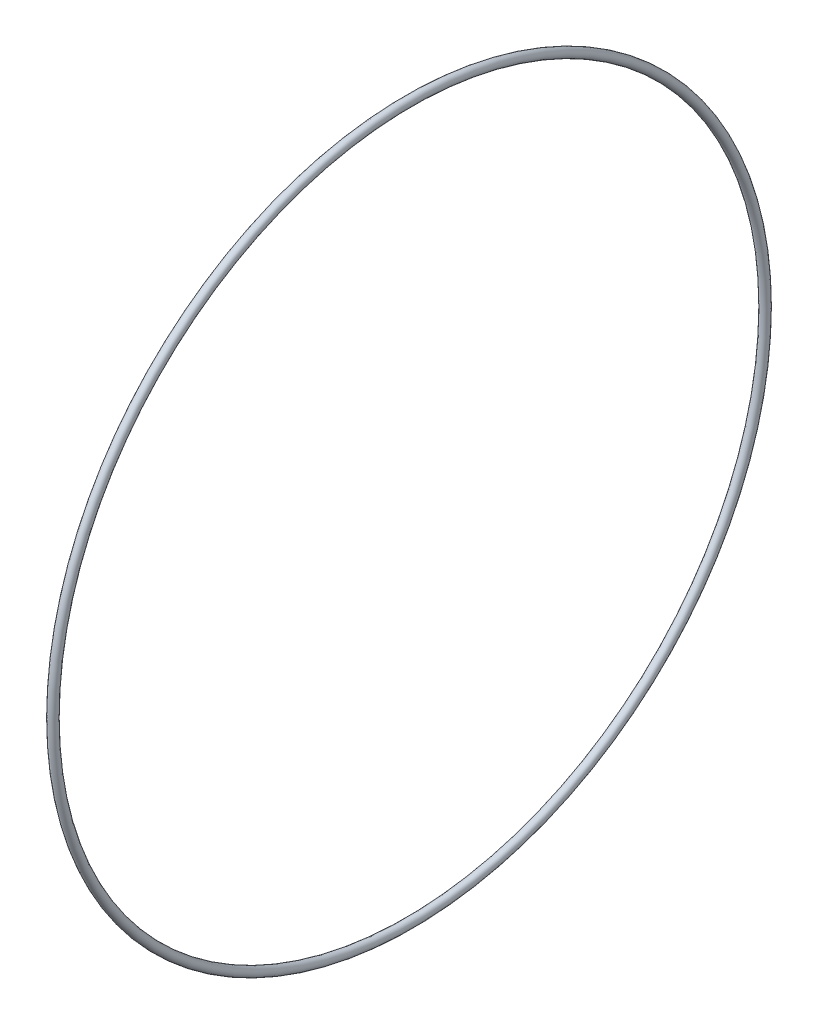
ISO-10303-21;
HEADER;
FILE_DESCRIPTION(('STEP AP214'),'2;1');
FILE_NAME('part.step','',(''),(''),'','','');
FILE_SCHEMA(('AUTOMOTIVE_DESIGN { 1 0 10303 214 1 1 1 1 }'));
ENDSEC;
DATA;
#1=APPLICATION_CONTEXT('core data for automotive mechanical design processes');
#2=APPLICATION_PROTOCOL_DEFINITION('international standard','automotive_design',2000,#1);
#3=PRODUCT_CONTEXT('',#1,'mechanical');
#4=PRODUCT('Part','Part','',(#3));
#5=PRODUCT_RELATED_PRODUCT_CATEGORY('part','',(#4));
#6=PRODUCT_DEFINITION_FORMATION('','',#4);
#7=PRODUCT_DEFINITION_CONTEXT('part definition',#1,'design');
#8=PRODUCT_DEFINITION('design','',#6,#7);
#9=PRODUCT_DEFINITION_SHAPE('','',#8);
#10=(LENGTH_UNIT() NAMED_UNIT(*) SI_UNIT(.MILLI.,.METRE.));
#11=(NAMED_UNIT(*) PLANE_ANGLE_UNIT() SI_UNIT($,.RADIAN.));
#12=(NAMED_UNIT(*) SI_UNIT($,.STERADIAN.) SOLID_ANGLE_UNIT());
#13=UNCERTAINTY_MEASURE_WITH_UNIT(LENGTH_MEASURE(1.E-05),#10,'distance_accuracy_value','');
#14=(GEOMETRIC_REPRESENTATION_CONTEXT(3) GLOBAL_UNCERTAINTY_ASSIGNED_CONTEXT((#13)) GLOBAL_UNIT_ASSIGNED_CONTEXT((#10,
#11,#12)) REPRESENTATION_CONTEXT('',''));
#15=CARTESIAN_POINT('',(0.,0.,0.));
#16=DIRECTION('',(0.,0.,1.));
#17=DIRECTION('',(1.,0.,0.));
#18=AXIS2_PLACEMENT_3D('',#15,#16,#17);
#19=CARTESIAN_POINT('',(0.,0.,0.));
#20=DIRECTION('',(1.,0.,0.));
#21=DIRECTION('',(0.,0.,-1.));
#22=AXIS2_PLACEMENT_3D('',#19,#20,#21);
#23=TOROIDAL_SURFACE('',#22,200.,2.5);
#24=CARTESIAN_POINT('',(0.,0.,-200.));
#25=DIRECTION('',(0.,1.,0.));
#26=DIRECTION('',(0.,0.,1.));
#27=AXIS2_PLACEMENT_3D('',#24,#25,#26);
#28=CIRCLE('',#27,2.5);
#29=CARTESIAN_POINT('',(0.,0.,-202.5));
#30=VERTEX_POINT('',#29);
#31=EDGE_CURVE('E11',#30,#30,#28,.T.);
#32=CARTESIAN_POINT('',(0.,0.,0.));
#33=DIRECTION('',(1.,0.,0.));
#34=DIRECTION('',(0.,0.,-1.));
#35=AXIS2_PLACEMENT_3D('',#32,#33,#34);
#36=CIRCLE('',#35,202.5);
#37=EDGE_CURVE('',#30,#30,#36,.T.);
#38=ORIENTED_EDGE('',*,*,#31,.T.);
#39=ORIENTED_EDGE('',*,*,#31,.F.);
#40=ORIENTED_EDGE('',*,*,#37,.T.);
#41=ORIENTED_EDGE('',*,*,#37,.F.);
#42=EDGE_LOOP('',(#38,#40,#39,#41));
#43=FACE_BOUND('',#42,.T.);
#44=ADVANCED_FACE('F49',(#43),#23,.T.);
#45=CLOSED_SHELL('',(#44));
#46=MANIFOLD_SOLID_BREP('B2',#45);
#47=ADVANCED_BREP_SHAPE_REPRESENTATION('',(#18,#46),#14);
#48=SHAPE_DEFINITION_REPRESENTATION(#9,#47);
ENDSEC;
END-ISO-10303-21;
